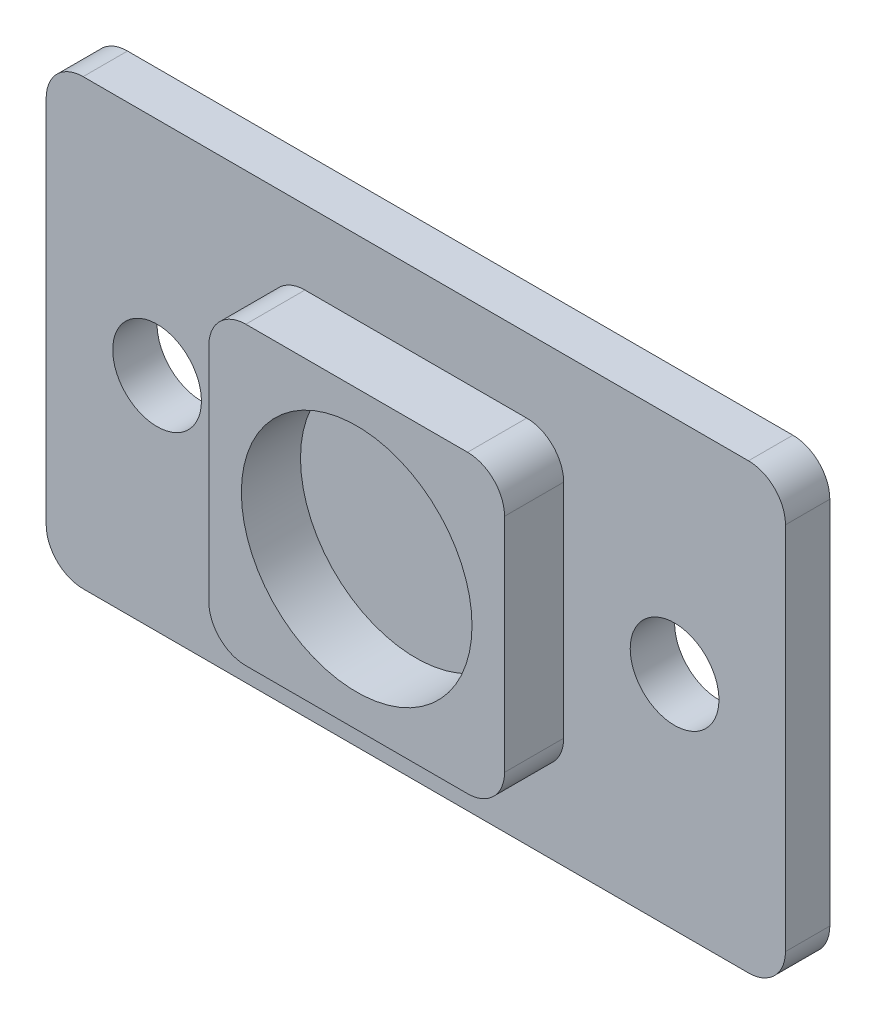
ISO-10303-21;
HEADER;
FILE_DESCRIPTION(('STEP AP214'),'2;1');
FILE_NAME('part.step','',(''),(''),'','','');
FILE_SCHEMA(('AUTOMOTIVE_DESIGN { 1 0 10303 214 1 1 1 1 }'));
ENDSEC;
DATA;
#1=APPLICATION_CONTEXT('core data for automotive mechanical design processes');
#2=APPLICATION_PROTOCOL_DEFINITION('international standard','automotive_design',2000,#1);
#3=PRODUCT_CONTEXT('',#1,'mechanical');
#4=PRODUCT('Part','Part','',(#3));
#5=PRODUCT_RELATED_PRODUCT_CATEGORY('part','',(#4));
#6=PRODUCT_DEFINITION_FORMATION('','',#4);
#7=PRODUCT_DEFINITION_CONTEXT('part definition',#1,'design');
#8=PRODUCT_DEFINITION('design','',#6,#7);
#9=PRODUCT_DEFINITION_SHAPE('','',#8);
#10=(LENGTH_UNIT() NAMED_UNIT(*) SI_UNIT(.MILLI.,.METRE.));
#11=(NAMED_UNIT(*) PLANE_ANGLE_UNIT() SI_UNIT($,.RADIAN.));
#12=(NAMED_UNIT(*) SI_UNIT($,.STERADIAN.) SOLID_ANGLE_UNIT());
#13=UNCERTAINTY_MEASURE_WITH_UNIT(LENGTH_MEASURE(1.E-05),#10,'distance_accuracy_value','');
#14=(GEOMETRIC_REPRESENTATION_CONTEXT(3) GLOBAL_UNCERTAINTY_ASSIGNED_CONTEXT((#13)) GLOBAL_UNIT_ASSIGNED_CONTEXT((#10,
#11,#12)) REPRESENTATION_CONTEXT('',''));
#15=CARTESIAN_POINT('',(0.,0.,0.));
#16=DIRECTION('',(0.,0.,1.));
#17=DIRECTION('',(1.,0.,0.));
#18=AXIS2_PLACEMENT_3D('',#15,#16,#17);
#19=CARTESIAN_POINT('',(0.,0.,1.5));
#20=DIRECTION('',(0.,0.,-1.));
#21=DIRECTION('',(-1.,0.,0.));
#22=AXIS2_PLACEMENT_3D('',#19,#20,#21);
#23=PLANE('',#22);
#24=CARTESIAN_POINT('',(-7.5,-7.5,1.5));
#25=DIRECTION('',(0.,0.,1.));
#26=DIRECTION('',(-1.,0.,0.));
#27=AXIS2_PLACEMENT_3D('',#24,#25,#26);
#28=CIRCLE('',#27,2.5);
#29=CARTESIAN_POINT('',(-10.,-7.49999999999998,1.5));
#30=VERTEX_POINT('',#29);
#31=CARTESIAN_POINT('',(-7.49999999999998,-10.,1.5));
#32=VERTEX_POINT('',#31);
#33=EDGE_CURVE('E167',#30,#32,#28,.T.);
#34=ORIENTED_EDGE('',*,*,#33,.F.);
#35=DIRECTION('',(0.,-1.,0.));
#36=VECTOR('',#35,1.);
#37=CARTESIAN_POINT('',(-10.,-7.49999999999998,1.5));
#38=LINE('',#37,#36);
#39=CARTESIAN_POINT('',(-10.,7.49999999999998,1.5));
#40=VERTEX_POINT('',#39);
#41=EDGE_CURVE('E164',#40,#30,#38,.T.);
#42=ORIENTED_EDGE('',*,*,#41,.F.);
#43=CARTESIAN_POINT('',(-7.5,7.5,1.5));
#44=DIRECTION('',(0.,0.,1.));
#45=DIRECTION('',(1.,0.,0.));
#46=AXIS2_PLACEMENT_3D('',#43,#44,#45);
#47=CIRCLE('',#46,2.5);
#48=CARTESIAN_POINT('',(-7.49999999999998,10.,1.5));
#49=VERTEX_POINT('',#48);
#50=EDGE_CURVE('E335',#49,#40,#47,.T.);
#51=ORIENTED_EDGE('',*,*,#50,.F.);
#52=DIRECTION('',(-1.,0.,0.));
#53=VECTOR('',#52,1.);
#54=CARTESIAN_POINT('',(7.49999999999998,10.,1.5));
#55=LINE('',#54,#53);
#56=CARTESIAN_POINT('',(7.49999999999998,10.,1.5));
#57=VERTEX_POINT('',#56);
#58=EDGE_CURVE('E332',#57,#49,#55,.T.);
#59=ORIENTED_EDGE('',*,*,#58,.F.);
#60=CARTESIAN_POINT('',(7.5,7.5,1.5));
#61=DIRECTION('',(0.,0.,1.));
#62=DIRECTION('',(1.,0.,0.));
#63=AXIS2_PLACEMENT_3D('',#60,#61,#62);
#64=CIRCLE('',#63,2.5);
#65=CARTESIAN_POINT('',(10.,7.49999999999998,1.5));
#66=VERTEX_POINT('',#65);
#67=EDGE_CURVE('E329',#66,#57,#64,.T.);
#68=ORIENTED_EDGE('',*,*,#67,.F.);
#69=DIRECTION('',(0.,1.,0.));
#70=VECTOR('',#69,1.);
#71=CARTESIAN_POINT('',(10.,-7.49999999999998,1.5));
#72=LINE('',#71,#70);
#73=CARTESIAN_POINT('',(10.,-7.5,1.5));
#74=VERTEX_POINT('',#73);
#75=EDGE_CURVE('E326',#74,#66,#72,.T.);
#76=ORIENTED_EDGE('',*,*,#75,.F.);
#77=CARTESIAN_POINT('',(7.5,-7.5,1.5));
#78=DIRECTION('',(0.,0.,1.));
#79=DIRECTION('',(1.,0.,0.));
#80=AXIS2_PLACEMENT_3D('',#77,#78,#79);
#81=CIRCLE('',#80,2.5);
#82=CARTESIAN_POINT('',(7.49999999999998,-10.,1.5));
#83=VERTEX_POINT('',#82);
#84=EDGE_CURVE('E53',#83,#74,#81,.T.);
#85=ORIENTED_EDGE('',*,*,#84,.F.);
#86=DIRECTION('',(1.,0.,0.));
#87=VECTOR('',#86,1.);
#88=CARTESIAN_POINT('',(7.49999999999998,-10.,1.5));
#89=LINE('',#88,#87);
#90=EDGE_CURVE('E48',#32,#83,#89,.T.);
#91=ORIENTED_EDGE('',*,*,#90,.F.);
#92=EDGE_LOOP('',(#34,#42,#51,#59,#68,#76,#85,#91));
#93=FACE_BOUND('',#92,.T.);
#94=DIRECTION('',(0.,-1.,0.));
#95=VECTOR('',#94,1.);
#96=CARTESIAN_POINT('',(-25.,-15.,1.5));
#97=LINE('',#96,#95);
#98=CARTESIAN_POINT('',(-25.,12.5,1.5));
#99=VERTEX_POINT('',#98);
#100=CARTESIAN_POINT('',(-25.,-12.5,1.5));
#101=VERTEX_POINT('',#100);
#102=EDGE_CURVE('E186',#99,#101,#97,.T.);
#103=ORIENTED_EDGE('',*,*,#102,.T.);
#104=CARTESIAN_POINT('',(-22.5,-12.5,1.5));
#105=DIRECTION('',(0.,0.,-1.));
#106=DIRECTION('',(-1.,0.,0.));
#107=AXIS2_PLACEMENT_3D('',#104,#105,#106);
#108=CIRCLE('',#107,2.5);
#109=CARTESIAN_POINT('',(-22.5,-15.,1.5));
#110=VERTEX_POINT('',#109);
#111=EDGE_CURVE('E233',#101,#110,#108,.F.);
#112=ORIENTED_EDGE('',*,*,#111,.T.);
#113=DIRECTION('',(1.,0.,0.));
#114=VECTOR('',#113,1.);
#115=CARTESIAN_POINT('',(25.,-15.,1.5));
#116=LINE('',#115,#114);
#117=CARTESIAN_POINT('',(22.5,-15.,1.5));
#118=VERTEX_POINT('',#117);
#119=EDGE_CURVE('E189',#110,#118,#116,.T.);
#120=ORIENTED_EDGE('',*,*,#119,.T.);
#121=CARTESIAN_POINT('',(22.5,-12.5,1.5));
#122=DIRECTION('',(0.,0.,-1.));
#123=DIRECTION('',(-1.,0.,0.));
#124=AXIS2_PLACEMENT_3D('',#121,#122,#123);
#125=CIRCLE('',#124,2.5);
#126=CARTESIAN_POINT('',(25.,-12.5,1.5));
#127=VERTEX_POINT('',#126);
#128=EDGE_CURVE('E231',#118,#127,#125,.F.);
#129=ORIENTED_EDGE('',*,*,#128,.T.);
#130=DIRECTION('',(0.,1.,0.));
#131=VECTOR('',#130,1.);
#132=CARTESIAN_POINT('',(25.,15.,1.5));
#133=LINE('',#132,#131);
#134=CARTESIAN_POINT('',(25.,12.5,1.5));
#135=VERTEX_POINT('',#134);
#136=EDGE_CURVE('E193',#127,#135,#133,.T.);
#137=ORIENTED_EDGE('',*,*,#136,.T.);
#138=CARTESIAN_POINT('',(22.5,12.5,1.5));
#139=DIRECTION('',(0.,0.,-1.));
#140=DIRECTION('',(-1.,0.,0.));
#141=AXIS2_PLACEMENT_3D('',#138,#139,#140);
#142=CIRCLE('',#141,2.5);
#143=CARTESIAN_POINT('',(22.5,15.,1.5));
#144=VERTEX_POINT('',#143);
#145=EDGE_CURVE('E229',#135,#144,#142,.F.);
#146=ORIENTED_EDGE('',*,*,#145,.T.);
#147=DIRECTION('',(-1.,0.,0.));
#148=VECTOR('',#147,1.);
#149=CARTESIAN_POINT('',(-25.,15.,1.5));
#150=LINE('',#149,#148);
#151=CARTESIAN_POINT('',(-22.5,15.,1.5));
#152=VERTEX_POINT('',#151);
#153=EDGE_CURVE('E196',#144,#152,#150,.T.);
#154=ORIENTED_EDGE('',*,*,#153,.T.);
#155=CARTESIAN_POINT('',(-22.5,12.5,1.5));
#156=DIRECTION('',(0.,0.,-1.));
#157=DIRECTION('',(-1.,0.,0.));
#158=AXIS2_PLACEMENT_3D('',#155,#156,#157);
#159=CIRCLE('',#158,2.5);
#160=EDGE_CURVE('E227',#152,#99,#159,.F.);
#161=ORIENTED_EDGE('',*,*,#160,.T.);
#162=EDGE_LOOP('',(#103,#112,#120,#129,#137,#146,#154,#161));
#163=FACE_BOUND('',#162,.T.);
#164=CARTESIAN_POINT('',(-17.5,0.,1.5));
#165=DIRECTION('',(0.,0.,1.));
#166=DIRECTION('',(1.,0.,0.));
#167=AXIS2_PLACEMENT_3D('',#164,#165,#166);
#168=CIRCLE('',#167,3.);
#169=CARTESIAN_POINT('',(-14.5,0.,1.5));
#170=VERTEX_POINT('',#169);
#171=EDGE_CURVE('E180',#170,#170,#168,.T.);
#172=ORIENTED_EDGE('',*,*,#171,.F.);
#173=EDGE_LOOP('',(#172));
#174=FACE_BOUND('',#173,.T.);
#175=CARTESIAN_POINT('',(17.5,0.,1.5));
#176=DIRECTION('',(0.,0.,1.));
#177=DIRECTION('',(-1.,0.,0.));
#178=AXIS2_PLACEMENT_3D('',#175,#176,#177);
#179=CIRCLE('',#178,3.);
#180=CARTESIAN_POINT('',(14.5,0.,1.5));
#181=VERTEX_POINT('',#180);
#182=EDGE_CURVE('E171',#181,#181,#179,.T.);
#183=ORIENTED_EDGE('',*,*,#182,.F.);
#184=EDGE_LOOP('',(#183));
#185=FACE_BOUND('',#184,.T.);
#186=ADVANCED_FACE('F33',(#93,#163,#174,#185),#23,.F.);
#187=CARTESIAN_POINT('',(0.,0.,-1.5));
#188=DIRECTION('',(0.,0.,-1.));
#189=DIRECTION('',(-1.,0.,0.));
#190=AXIS2_PLACEMENT_3D('',#187,#188,#189);
#191=PLANE('',#190);
#192=CARTESIAN_POINT('',(-17.5,0.,-1.5));
#193=DIRECTION('',(0.,0.,1.));
#194=DIRECTION('',(1.,0.,0.));
#195=AXIS2_PLACEMENT_3D('',#192,#193,#194);
#196=CIRCLE('',#195,3.);
#197=CARTESIAN_POINT('',(-14.5,0.,-1.5));
#198=VERTEX_POINT('',#197);
#199=EDGE_CURVE('E178',#198,#198,#196,.T.);
#200=ORIENTED_EDGE('',*,*,#199,.T.);
#201=EDGE_LOOP('',(#200));
#202=FACE_BOUND('',#201,.T.);
#203=DIRECTION('',(1.,0.,0.));
#204=VECTOR('',#203,1.);
#205=CARTESIAN_POINT('',(25.,-15.,-1.5));
#206=LINE('',#205,#204);
#207=CARTESIAN_POINT('',(-22.5,-15.,-1.5));
#208=VERTEX_POINT('',#207);
#209=CARTESIAN_POINT('',(22.5,-15.,-1.5));
#210=VERTEX_POINT('',#209);
#211=EDGE_CURVE('E202',#208,#210,#206,.T.);
#212=ORIENTED_EDGE('',*,*,#211,.F.);
#213=CARTESIAN_POINT('',(-22.5,-12.5,-1.5));
#214=DIRECTION('',(0.,0.,-1.));
#215=DIRECTION('',(-1.,0.,0.));
#216=AXIS2_PLACEMENT_3D('',#213,#214,#215);
#217=CIRCLE('',#216,2.5);
#218=CARTESIAN_POINT('',(-25.,-12.5,-1.5));
#219=VERTEX_POINT('',#218);
#220=EDGE_CURVE('E220',#208,#219,#217,.T.);
#221=ORIENTED_EDGE('',*,*,#220,.T.);
#222=DIRECTION('',(0.,-1.,0.));
#223=VECTOR('',#222,1.);
#224=CARTESIAN_POINT('',(-25.,-15.,-1.5));
#225=LINE('',#224,#223);
#226=CARTESIAN_POINT('',(-25.,12.5,-1.5));
#227=VERTEX_POINT('',#226);
#228=EDGE_CURVE('E183',#227,#219,#225,.T.);
#229=ORIENTED_EDGE('',*,*,#228,.F.);
#230=CARTESIAN_POINT('',(-22.5,12.5,-1.5));
#231=DIRECTION('',(0.,0.,-1.));
#232=DIRECTION('',(-1.,0.,0.));
#233=AXIS2_PLACEMENT_3D('',#230,#231,#232);
#234=CIRCLE('',#233,2.5);
#235=CARTESIAN_POINT('',(-22.5,15.,-1.5));
#236=VERTEX_POINT('',#235);
#237=EDGE_CURVE('E214',#227,#236,#234,.T.);
#238=ORIENTED_EDGE('',*,*,#237,.T.);
#239=DIRECTION('',(-1.,0.,0.));
#240=VECTOR('',#239,1.);
#241=CARTESIAN_POINT('',(-25.,15.,-1.5));
#242=LINE('',#241,#240);
#243=CARTESIAN_POINT('',(22.5,15.,-1.5));
#244=VERTEX_POINT('',#243);
#245=EDGE_CURVE('E190',#244,#236,#242,.T.);
#246=ORIENTED_EDGE('',*,*,#245,.F.);
#247=CARTESIAN_POINT('',(22.5,12.5,-1.5));
#248=DIRECTION('',(0.,0.,-1.));
#249=DIRECTION('',(-1.,0.,0.));
#250=AXIS2_PLACEMENT_3D('',#247,#248,#249);
#251=CIRCLE('',#250,2.5);
#252=CARTESIAN_POINT('',(25.,12.5,-1.5));
#253=VERTEX_POINT('',#252);
#254=EDGE_CURVE('E216',#244,#253,#251,.T.);
#255=ORIENTED_EDGE('',*,*,#254,.T.);
#256=DIRECTION('',(0.,1.,0.));
#257=VECTOR('',#256,1.);
#258=CARTESIAN_POINT('',(25.,15.,-1.5));
#259=LINE('',#258,#257);
#260=CARTESIAN_POINT('',(25.,-12.5,-1.5));
#261=VERTEX_POINT('',#260);
#262=EDGE_CURVE('E205',#261,#253,#259,.T.);
#263=ORIENTED_EDGE('',*,*,#262,.F.);
#264=CARTESIAN_POINT('',(22.5,-12.5,-1.5));
#265=DIRECTION('',(0.,0.,-1.));
#266=DIRECTION('',(-1.,0.,0.));
#267=AXIS2_PLACEMENT_3D('',#264,#265,#266);
#268=CIRCLE('',#267,2.5);
#269=EDGE_CURVE('E218',#261,#210,#268,.T.);
#270=ORIENTED_EDGE('',*,*,#269,.T.);
#271=EDGE_LOOP('',(#212,#221,#229,#238,#246,#255,#263,#270));
#272=FACE_BOUND('',#271,.T.);
#273=CARTESIAN_POINT('',(17.5,0.,-1.5));
#274=DIRECTION('',(0.,0.,1.));
#275=DIRECTION('',(-1.,0.,0.));
#276=AXIS2_PLACEMENT_3D('',#273,#274,#275);
#277=CIRCLE('',#276,3.);
#278=CARTESIAN_POINT('',(14.5,0.,-1.5));
#279=VERTEX_POINT('',#278);
#280=EDGE_CURVE('E168',#279,#279,#277,.T.);
#281=ORIENTED_EDGE('',*,*,#280,.T.);
#282=EDGE_LOOP('',(#281));
#283=FACE_BOUND('',#282,.T.);
#284=ADVANCED_FACE('F258',(#202,#272,#283),#191,.T.);
#285=CARTESIAN_POINT('',(-25.,-15.,1.5));
#286=DIRECTION('',(1.,0.,0.));
#287=DIRECTION('',(0.,1.,0.));
#288=AXIS2_PLACEMENT_3D('',#285,#286,#287);
#289=PLANE('',#288);
#290=ORIENTED_EDGE('',*,*,#228,.T.);
#291=DIRECTION('',(0.,0.,-1.));
#292=VECTOR('',#291,1.);
#293=CARTESIAN_POINT('',(-25.,-12.5,1.5));
#294=LINE('',#293,#292);
#295=EDGE_CURVE('E225',#219,#101,#294,.F.);
#296=ORIENTED_EDGE('',*,*,#295,.T.);
#297=ORIENTED_EDGE('',*,*,#102,.F.);
#298=DIRECTION('',(0.,0.,-1.));
#299=VECTOR('',#298,1.);
#300=CARTESIAN_POINT('',(-25.,12.5,1.5));
#301=LINE('',#300,#299);
#302=EDGE_CURVE('E222',#99,#227,#301,.T.);
#303=ORIENTED_EDGE('',*,*,#302,.T.);
#304=EDGE_LOOP('',(#290,#296,#297,#303));
#305=FACE_BOUND('',#304,.T.);
#306=ADVANCED_FACE('F254',(#305),#289,.F.);
#307=CARTESIAN_POINT('',(25.,-15.,1.5));
#308=DIRECTION('',(0.,1.,0.));
#309=DIRECTION('',(-1.,0.,0.));
#310=AXIS2_PLACEMENT_3D('',#307,#308,#309);
#311=PLANE('',#310);
#312=ORIENTED_EDGE('',*,*,#119,.F.);
#313=DIRECTION('',(0.,0.,-1.));
#314=VECTOR('',#313,1.);
#315=CARTESIAN_POINT('',(-22.5,-15.,1.5));
#316=LINE('',#315,#314);
#317=EDGE_CURVE('E211',#110,#208,#316,.T.);
#318=ORIENTED_EDGE('',*,*,#317,.T.);
#319=ORIENTED_EDGE('',*,*,#211,.T.);
#320=DIRECTION('',(0.,0.,-1.));
#321=VECTOR('',#320,1.);
#322=CARTESIAN_POINT('',(22.5,-15.,1.5));
#323=LINE('',#322,#321);
#324=EDGE_CURVE('E199',#210,#118,#323,.F.);
#325=ORIENTED_EDGE('',*,*,#324,.T.);
#326=EDGE_LOOP('',(#312,#318,#319,#325));
#327=FACE_BOUND('',#326,.T.);
#328=ADVANCED_FACE('F266',(#327),#311,.F.);
#329=CARTESIAN_POINT('',(25.,15.,1.5));
#330=DIRECTION('',(-1.,0.,0.));
#331=DIRECTION('',(0.,-1.,0.));
#332=AXIS2_PLACEMENT_3D('',#329,#330,#331);
#333=PLANE('',#332);
#334=ORIENTED_EDGE('',*,*,#136,.F.);
#335=DIRECTION('',(0.,0.,-1.));
#336=VECTOR('',#335,1.);
#337=CARTESIAN_POINT('',(25.,-12.5,1.5));
#338=LINE('',#337,#336);
#339=EDGE_CURVE('E237',#127,#261,#338,.T.);
#340=ORIENTED_EDGE('',*,*,#339,.T.);
#341=ORIENTED_EDGE('',*,*,#262,.T.);
#342=DIRECTION('',(0.,0.,-1.));
#343=VECTOR('',#342,1.);
#344=CARTESIAN_POINT('',(25.,12.5,1.5));
#345=LINE('',#344,#343);
#346=EDGE_CURVE('E235',#253,#135,#345,.F.);
#347=ORIENTED_EDGE('',*,*,#346,.T.);
#348=EDGE_LOOP('',(#334,#340,#341,#347));
#349=FACE_BOUND('',#348,.T.);
#350=ADVANCED_FACE('F275',(#349),#333,.F.);
#351=CARTESIAN_POINT('',(-25.,15.,1.5));
#352=DIRECTION('',(0.,-1.,0.));
#353=DIRECTION('',(0.,0.,-1.));
#354=AXIS2_PLACEMENT_3D('',#351,#352,#353);
#355=PLANE('',#354);
#356=ORIENTED_EDGE('',*,*,#153,.F.);
#357=DIRECTION('',(0.,0.,-1.));
#358=VECTOR('',#357,1.);
#359=CARTESIAN_POINT('',(22.5,15.,1.5));
#360=LINE('',#359,#358);
#361=EDGE_CURVE('E11',#144,#244,#360,.T.);
#362=ORIENTED_EDGE('',*,*,#361,.T.);
#363=ORIENTED_EDGE('',*,*,#245,.T.);
#364=DIRECTION('',(0.,0.,-1.));
#365=VECTOR('',#364,1.);
#366=CARTESIAN_POINT('',(-22.5,15.,1.5));
#367=LINE('',#366,#365);
#368=EDGE_CURVE('E41',#236,#152,#367,.F.);
#369=ORIENTED_EDGE('',*,*,#368,.T.);
#370=EDGE_LOOP('',(#356,#362,#363,#369));
#371=FACE_BOUND('',#370,.T.);
#372=ADVANCED_FACE('F242',(#371),#355,.F.);
#373=CARTESIAN_POINT('',(-17.5,0.,1.5));
#374=DIRECTION('',(0.,0.,-1.));
#375=DIRECTION('',(-1.,0.,0.));
#376=AXIS2_PLACEMENT_3D('',#373,#374,#375);
#377=CYLINDRICAL_SURFACE('',#376,3.);
#378=ORIENTED_EDGE('',*,*,#171,.T.);
#379=EDGE_LOOP('',(#378));
#380=FACE_BOUND('',#379,.T.);
#381=ORIENTED_EDGE('',*,*,#199,.F.);
#382=EDGE_LOOP('',(#381));
#383=FACE_BOUND('',#382,.T.);
#384=ADVANCED_FACE('F395',(#380,#383),#377,.F.);
#385=CARTESIAN_POINT('',(17.5,0.,1.5));
#386=DIRECTION('',(0.,0.,-1.));
#387=DIRECTION('',(-1.,0.,0.));
#388=AXIS2_PLACEMENT_3D('',#385,#386,#387);
#389=CYLINDRICAL_SURFACE('',#388,3.);
#390=ORIENTED_EDGE('',*,*,#182,.T.);
#391=EDGE_LOOP('',(#390));
#392=FACE_BOUND('',#391,.T.);
#393=ORIENTED_EDGE('',*,*,#280,.F.);
#394=EDGE_LOOP('',(#393));
#395=FACE_BOUND('',#394,.T.);
#396=ADVANCED_FACE('F393',(#392,#395),#389,.F.);
#397=CARTESIAN_POINT('',(-22.5,-12.5,1.5));
#398=DIRECTION('',(0.,0.,-1.));
#399=DIRECTION('',(-1.,0.,0.));
#400=AXIS2_PLACEMENT_3D('',#397,#398,#399);
#401=CYLINDRICAL_SURFACE('',#400,2.5);
#402=ORIENTED_EDGE('',*,*,#111,.F.);
#403=ORIENTED_EDGE('',*,*,#295,.F.);
#404=ORIENTED_EDGE('',*,*,#220,.F.);
#405=ORIENTED_EDGE('',*,*,#317,.F.);
#406=EDGE_LOOP('',(#402,#403,#404,#405));
#407=FACE_BOUND('',#406,.T.);
#408=ADVANCED_FACE('F263',(#407),#401,.T.);
#409=CARTESIAN_POINT('',(22.5,-12.5,1.5));
#410=DIRECTION('',(0.,0.,-1.));
#411=DIRECTION('',(-1.,0.,0.));
#412=AXIS2_PLACEMENT_3D('',#409,#410,#411);
#413=CYLINDRICAL_SURFACE('',#412,2.5);
#414=ORIENTED_EDGE('',*,*,#128,.F.);
#415=ORIENTED_EDGE('',*,*,#324,.F.);
#416=ORIENTED_EDGE('',*,*,#269,.F.);
#417=ORIENTED_EDGE('',*,*,#339,.F.);
#418=EDGE_LOOP('',(#414,#415,#416,#417));
#419=FACE_BOUND('',#418,.T.);
#420=ADVANCED_FACE('F272',(#419),#413,.T.);
#421=CARTESIAN_POINT('',(22.5,12.5,1.5));
#422=DIRECTION('',(0.,0.,-1.));
#423=DIRECTION('',(-1.,0.,0.));
#424=AXIS2_PLACEMENT_3D('',#421,#422,#423);
#425=CYLINDRICAL_SURFACE('',#424,2.5);
#426=ORIENTED_EDGE('',*,*,#145,.F.);
#427=ORIENTED_EDGE('',*,*,#346,.F.);
#428=ORIENTED_EDGE('',*,*,#254,.F.);
#429=ORIENTED_EDGE('',*,*,#361,.F.);
#430=EDGE_LOOP('',(#426,#427,#428,#429));
#431=FACE_BOUND('',#430,.T.);
#432=ADVANCED_FACE('F278',(#431),#425,.T.);
#433=CARTESIAN_POINT('',(-22.5,12.5,1.5));
#434=DIRECTION('',(0.,0.,-1.));
#435=DIRECTION('',(-1.,0.,0.));
#436=AXIS2_PLACEMENT_3D('',#433,#434,#435);
#437=CYLINDRICAL_SURFACE('',#436,2.5);
#438=ORIENTED_EDGE('',*,*,#160,.F.);
#439=ORIENTED_EDGE('',*,*,#368,.F.);
#440=ORIENTED_EDGE('',*,*,#237,.F.);
#441=ORIENTED_EDGE('',*,*,#302,.F.);
#442=EDGE_LOOP('',(#438,#439,#440,#441));
#443=FACE_BOUND('',#442,.T.);
#444=ADVANCED_FACE('F35',(#443),#437,.T.);
#445=CARTESIAN_POINT('',(-7.5,-7.5,5.5));
#446=DIRECTION('',(0.,0.,-1.));
#447=DIRECTION('',(-1.,0.,0.));
#448=AXIS2_PLACEMENT_3D('',#445,#446,#447);
#449=PLANE('',#448);
#450=CARTESIAN_POINT('',(-7.5,-7.5,5.5));
#451=DIRECTION('',(0.,0.,1.));
#452=DIRECTION('',(-1.,0.,0.));
#453=AXIS2_PLACEMENT_3D('',#450,#451,#452);
#454=CIRCLE('',#453,2.5);
#455=CARTESIAN_POINT('',(-10.,-7.49999999999998,5.5));
#456=VERTEX_POINT('',#455);
#457=CARTESIAN_POINT('',(-7.49999999999998,-10.,5.5));
#458=VERTEX_POINT('',#457);
#459=EDGE_CURVE('E154',#456,#458,#454,.T.);
#460=ORIENTED_EDGE('',*,*,#459,.T.);
#461=DIRECTION('',(1.,0.,0.));
#462=VECTOR('',#461,1.);
#463=CARTESIAN_POINT('',(7.49999999999998,-10.,5.5));
#464=LINE('',#463,#462);
#465=CARTESIAN_POINT('',(7.49999999999998,-10.,5.5));
#466=VERTEX_POINT('',#465);
#467=EDGE_CURVE('E143',#458,#466,#464,.T.);
#468=ORIENTED_EDGE('',*,*,#467,.T.);
#469=CARTESIAN_POINT('',(7.5,-7.5,5.5));
#470=DIRECTION('',(0.,0.,1.));
#471=DIRECTION('',(1.,0.,0.));
#472=AXIS2_PLACEMENT_3D('',#469,#470,#471);
#473=CIRCLE('',#472,2.5);
#474=CARTESIAN_POINT('',(10.,-7.5,5.5));
#475=VERTEX_POINT('',#474);
#476=EDGE_CURVE('E153',#466,#475,#473,.T.);
#477=ORIENTED_EDGE('',*,*,#476,.T.);
#478=DIRECTION('',(0.,1.,0.));
#479=VECTOR('',#478,1.);
#480=CARTESIAN_POINT('',(10.,-7.49999999999998,5.5));
#481=LINE('',#480,#479);
#482=CARTESIAN_POINT('',(10.,7.49999999999998,5.5));
#483=VERTEX_POINT('',#482);
#484=EDGE_CURVE('E313',#475,#483,#481,.T.);
#485=ORIENTED_EDGE('',*,*,#484,.T.);
#486=CARTESIAN_POINT('',(7.5,7.5,5.5));
#487=DIRECTION('',(0.,0.,1.));
#488=DIRECTION('',(1.,0.,0.));
#489=AXIS2_PLACEMENT_3D('',#486,#487,#488);
#490=CIRCLE('',#489,2.5);
#491=CARTESIAN_POINT('',(7.49999999999998,10.,5.5));
#492=VERTEX_POINT('',#491);
#493=EDGE_CURVE('E315',#483,#492,#490,.T.);
#494=ORIENTED_EDGE('',*,*,#493,.T.);
#495=DIRECTION('',(-1.,0.,0.));
#496=VECTOR('',#495,1.);
#497=CARTESIAN_POINT('',(7.49999999999998,10.,5.5));
#498=LINE('',#497,#496);
#499=CARTESIAN_POINT('',(-7.49999999999998,10.,5.5));
#500=VERTEX_POINT('',#499);
#501=EDGE_CURVE('E317',#492,#500,#498,.T.);
#502=ORIENTED_EDGE('',*,*,#501,.T.);
#503=CARTESIAN_POINT('',(-7.5,7.5,5.5));
#504=DIRECTION('',(0.,0.,1.));
#505=DIRECTION('',(1.,0.,0.));
#506=AXIS2_PLACEMENT_3D('',#503,#504,#505);
#507=CIRCLE('',#506,2.5);
#508=CARTESIAN_POINT('',(-10.,7.49999999999998,5.5));
#509=VERTEX_POINT('',#508);
#510=EDGE_CURVE('E319',#500,#509,#507,.T.);
#511=ORIENTED_EDGE('',*,*,#510,.T.);
#512=DIRECTION('',(0.,-1.,0.));
#513=VECTOR('',#512,1.);
#514=CARTESIAN_POINT('',(-10.,-7.49999999999998,5.5));
#515=LINE('',#514,#513);
#516=EDGE_CURVE('E160',#509,#456,#515,.T.);
#517=ORIENTED_EDGE('',*,*,#516,.T.);
#518=EDGE_LOOP('',(#460,#468,#477,#485,#494,#502,#511,#517));
#519=FACE_BOUND('',#518,.T.);
#520=CARTESIAN_POINT('',(0.,0.,5.5));
#521=DIRECTION('',(0.,0.,1.));
#522=DIRECTION('',(1.,0.,0.));
#523=AXIS2_PLACEMENT_3D('',#520,#521,#522);
#524=CIRCLE('',#523,7.8);
#525=CARTESIAN_POINT('',(7.8,0.,5.5));
#526=VERTEX_POINT('',#525);
#527=EDGE_CURVE('E307',#526,#526,#524,.T.);
#528=ORIENTED_EDGE('',*,*,#527,.F.);
#529=EDGE_LOOP('',(#528));
#530=FACE_BOUND('',#529,.T.);
#531=ADVANCED_FACE('F157',(#519,#530),#449,.F.);
#532=CARTESIAN_POINT('',(-7.5,-7.5,5.5));
#533=DIRECTION('',(0.,0.,-1.));
#534=DIRECTION('',(-1.,0.,0.));
#535=AXIS2_PLACEMENT_3D('',#532,#533,#534);
#536=CYLINDRICAL_SURFACE('',#535,2.5);
#537=ORIENTED_EDGE('',*,*,#33,.T.);
#538=DIRECTION('',(0.,0.,-1.));
#539=VECTOR('',#538,1.);
#540=CARTESIAN_POINT('',(-7.49999999999998,-10.,5.5));
#541=LINE('',#540,#539);
#542=EDGE_CURVE('E147',#458,#32,#541,.T.);
#543=ORIENTED_EDGE('',*,*,#542,.F.);
#544=ORIENTED_EDGE('',*,*,#459,.F.);
#545=DIRECTION('',(0.,0.,-1.));
#546=VECTOR('',#545,1.);
#547=CARTESIAN_POINT('',(-10.,-7.49999999999998,5.5));
#548=LINE('',#547,#546);
#549=EDGE_CURVE('E322',#456,#30,#548,.T.);
#550=ORIENTED_EDGE('',*,*,#549,.T.);
#551=EDGE_LOOP('',(#537,#543,#544,#550));
#552=FACE_BOUND('',#551,.T.);
#553=ADVANCED_FACE('F166',(#552),#536,.T.);
#554=CARTESIAN_POINT('',(7.49999999999998,-10.,5.5));
#555=DIRECTION('',(0.,1.,0.));
#556=DIRECTION('',(-1.,0.,0.));
#557=AXIS2_PLACEMENT_3D('',#554,#555,#556);
#558=PLANE('',#557);
#559=ORIENTED_EDGE('',*,*,#90,.T.);
#560=DIRECTION('',(0.,0.,-1.));
#561=VECTOR('',#560,1.);
#562=CARTESIAN_POINT('',(7.49999999999998,-10.,5.5));
#563=LINE('',#562,#561);
#564=EDGE_CURVE('E150',#466,#83,#563,.T.);
#565=ORIENTED_EDGE('',*,*,#564,.F.);
#566=ORIENTED_EDGE('',*,*,#467,.F.);
#567=ORIENTED_EDGE('',*,*,#542,.T.);
#568=EDGE_LOOP('',(#559,#565,#566,#567));
#569=FACE_BOUND('',#568,.T.);
#570=ADVANCED_FACE('F145',(#569),#558,.F.);
#571=CARTESIAN_POINT('',(7.5,-7.5,5.5));
#572=DIRECTION('',(0.,0.,-1.));
#573=DIRECTION('',(-1.,0.,0.));
#574=AXIS2_PLACEMENT_3D('',#571,#572,#573);
#575=CYLINDRICAL_SURFACE('',#574,2.5);
#576=ORIENTED_EDGE('',*,*,#84,.T.);
#577=DIRECTION('',(0.,0.,-1.));
#578=VECTOR('',#577,1.);
#579=CARTESIAN_POINT('',(10.,-7.5,5.5));
#580=LINE('',#579,#578);
#581=EDGE_CURVE('E173',#475,#74,#580,.T.);
#582=ORIENTED_EDGE('',*,*,#581,.F.);
#583=ORIENTED_EDGE('',*,*,#476,.F.);
#584=ORIENTED_EDGE('',*,*,#564,.T.);
#585=EDGE_LOOP('',(#576,#582,#583,#584));
#586=FACE_BOUND('',#585,.T.);
#587=ADVANCED_FACE('F359',(#586),#575,.T.);
#588=CARTESIAN_POINT('',(10.,-7.49999999999998,5.5));
#589=DIRECTION('',(-1.,0.,0.));
#590=DIRECTION('',(0.,0.,1.));
#591=AXIS2_PLACEMENT_3D('',#588,#589,#590);
#592=PLANE('',#591);
#593=ORIENTED_EDGE('',*,*,#75,.T.);
#594=DIRECTION('',(0.,0.,-1.));
#595=VECTOR('',#594,1.);
#596=CARTESIAN_POINT('',(10.,7.49999999999998,5.5));
#597=LINE('',#596,#595);
#598=EDGE_CURVE('E350',#483,#66,#597,.T.);
#599=ORIENTED_EDGE('',*,*,#598,.F.);
#600=ORIENTED_EDGE('',*,*,#484,.F.);
#601=ORIENTED_EDGE('',*,*,#581,.T.);
#602=EDGE_LOOP('',(#593,#599,#600,#601));
#603=FACE_BOUND('',#602,.T.);
#604=ADVANCED_FACE('F356',(#603),#592,.F.);
#605=CARTESIAN_POINT('',(7.5,7.5,5.5));
#606=DIRECTION('',(0.,0.,-1.));
#607=DIRECTION('',(-1.,0.,0.));
#608=AXIS2_PLACEMENT_3D('',#605,#606,#607);
#609=CYLINDRICAL_SURFACE('',#608,2.5);
#610=ORIENTED_EDGE('',*,*,#67,.T.);
#611=DIRECTION('',(0.,0.,-1.));
#612=VECTOR('',#611,1.);
#613=CARTESIAN_POINT('',(7.49999999999998,10.,5.5));
#614=LINE('',#613,#612);
#615=EDGE_CURVE('E347',#492,#57,#614,.T.);
#616=ORIENTED_EDGE('',*,*,#615,.F.);
#617=ORIENTED_EDGE('',*,*,#493,.F.);
#618=ORIENTED_EDGE('',*,*,#598,.T.);
#619=EDGE_LOOP('',(#610,#616,#617,#618));
#620=FACE_BOUND('',#619,.T.);
#621=ADVANCED_FACE('F363',(#620),#609,.T.);
#622=CARTESIAN_POINT('',(7.49999999999998,10.,5.5));
#623=DIRECTION('',(0.,-1.,0.));
#624=DIRECTION('',(1.,0.,0.));
#625=AXIS2_PLACEMENT_3D('',#622,#623,#624);
#626=PLANE('',#625);
#627=ORIENTED_EDGE('',*,*,#58,.T.);
#628=DIRECTION('',(0.,0.,-1.));
#629=VECTOR('',#628,1.);
#630=CARTESIAN_POINT('',(-7.49999999999998,10.,5.5));
#631=LINE('',#630,#629);
#632=EDGE_CURVE('E344',#500,#49,#631,.T.);
#633=ORIENTED_EDGE('',*,*,#632,.F.);
#634=ORIENTED_EDGE('',*,*,#501,.F.);
#635=ORIENTED_EDGE('',*,*,#615,.T.);
#636=EDGE_LOOP('',(#627,#633,#634,#635));
#637=FACE_BOUND('',#636,.T.);
#638=ADVANCED_FACE('F367',(#637),#626,.F.);
#639=CARTESIAN_POINT('',(-7.5,7.5,5.5));
#640=DIRECTION('',(0.,0.,-1.));
#641=DIRECTION('',(-1.,0.,0.));
#642=AXIS2_PLACEMENT_3D('',#639,#640,#641);
#643=CYLINDRICAL_SURFACE('',#642,2.5);
#644=ORIENTED_EDGE('',*,*,#50,.T.);
#645=DIRECTION('',(0.,0.,-1.));
#646=VECTOR('',#645,1.);
#647=CARTESIAN_POINT('',(-10.,7.49999999999998,5.5));
#648=LINE('',#647,#646);
#649=EDGE_CURVE('E341',#509,#40,#648,.T.);
#650=ORIENTED_EDGE('',*,*,#649,.F.);
#651=ORIENTED_EDGE('',*,*,#510,.F.);
#652=ORIENTED_EDGE('',*,*,#632,.T.);
#653=EDGE_LOOP('',(#644,#650,#651,#652));
#654=FACE_BOUND('',#653,.T.);
#655=ADVANCED_FACE('F371',(#654),#643,.T.);
#656=CARTESIAN_POINT('',(-10.,-7.49999999999998,5.5));
#657=DIRECTION('',(1.,0.,0.));
#658=DIRECTION('',(0.,0.,-1.));
#659=AXIS2_PLACEMENT_3D('',#656,#657,#658);
#660=PLANE('',#659);
#661=ORIENTED_EDGE('',*,*,#41,.T.);
#662=ORIENTED_EDGE('',*,*,#549,.F.);
#663=ORIENTED_EDGE('',*,*,#516,.F.);
#664=ORIENTED_EDGE('',*,*,#649,.T.);
#665=EDGE_LOOP('',(#661,#662,#663,#664));
#666=FACE_BOUND('',#665,.T.);
#667=ADVANCED_FACE('F300',(#666),#660,.F.);
#668=CARTESIAN_POINT('',(0.,0.,5.5));
#669=DIRECTION('',(0.,0.,-1.));
#670=DIRECTION('',(-1.,0.,0.));
#671=AXIS2_PLACEMENT_3D('',#668,#669,#670);
#672=CYLINDRICAL_SURFACE('',#671,7.8);
#673=ORIENTED_EDGE('',*,*,#527,.T.);
#674=EDGE_LOOP('',(#673));
#675=FACE_BOUND('',#674,.T.);
#676=CARTESIAN_POINT('',(0.,0.,1.5));
#677=DIRECTION('',(0.,0.,1.));
#678=DIRECTION('',(1.,0.,0.));
#679=AXIS2_PLACEMENT_3D('',#676,#677,#678);
#680=CIRCLE('',#679,7.8);
#681=CARTESIAN_POINT('',(7.8,0.,1.5));
#682=VERTEX_POINT('',#681);
#683=EDGE_CURVE('E305',#682,#682,#680,.T.);
#684=ORIENTED_EDGE('',*,*,#683,.F.);
#685=EDGE_LOOP('',(#684));
#686=FACE_BOUND('',#685,.T.);
#687=ADVANCED_FACE('F295',(#675,#686),#672,.F.);
#688=ORIENTED_EDGE('',*,*,#683,.T.);
#689=EDGE_LOOP('',(#688));
#690=FACE_BOUND('',#689,.T.);
#691=ADVANCED_FACE('F287',(#690),#23,.F.);
#692=CLOSED_SHELL('',(#186,#284,#306,#328,#350,#372,#384,#396,#408,#420,#432,#444,#531,#553,
#570,#587,#604,#621,#638,#655,#667,#687,#691));
#693=MANIFOLD_SOLID_BREP('B2',#692);
#694=ADVANCED_BREP_SHAPE_REPRESENTATION('',(#18,#693),#14);
#695=SHAPE_DEFINITION_REPRESENTATION(#9,#694);
ENDSEC;
END-ISO-10303-21;
